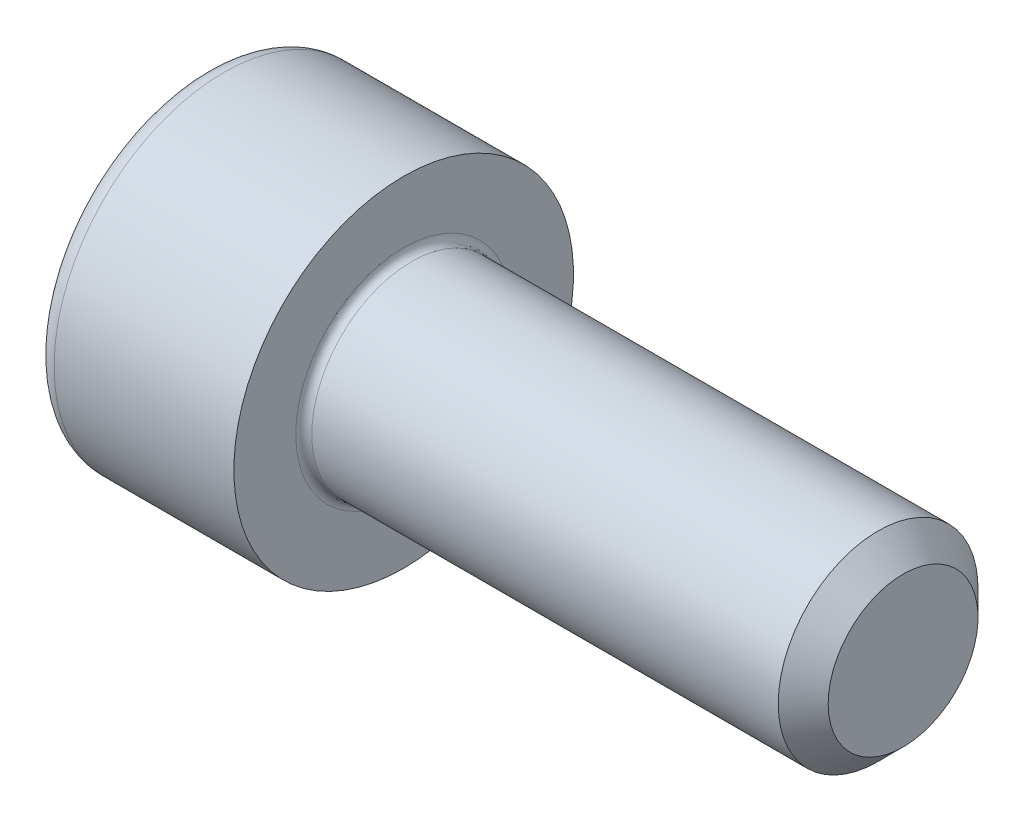
ISO-10303-21;
HEADER;
FILE_DESCRIPTION(('STEP AP214'),'2;1');
FILE_NAME('part.step','',(''),(''),'','','');
FILE_SCHEMA(('AUTOMOTIVE_DESIGN { 1 0 10303 214 1 1 1 1 }'));
ENDSEC;
DATA;
#1=APPLICATION_CONTEXT('core data for automotive mechanical design processes');
#2=APPLICATION_PROTOCOL_DEFINITION('international standard','automotive_design',2000,#1);
#3=PRODUCT_CONTEXT('',#1,'mechanical');
#4=PRODUCT('Part','Part','',(#3));
#5=PRODUCT_RELATED_PRODUCT_CATEGORY('part','',(#4));
#6=PRODUCT_DEFINITION_FORMATION('','',#4);
#7=PRODUCT_DEFINITION_CONTEXT('part definition',#1,'design');
#8=PRODUCT_DEFINITION('design','',#6,#7);
#9=PRODUCT_DEFINITION_SHAPE('','',#8);
#10=(LENGTH_UNIT() NAMED_UNIT(*) SI_UNIT(.MILLI.,.METRE.));
#11=(NAMED_UNIT(*) PLANE_ANGLE_UNIT() SI_UNIT($,.RADIAN.));
#12=(NAMED_UNIT(*) SI_UNIT($,.STERADIAN.) SOLID_ANGLE_UNIT());
#13=UNCERTAINTY_MEASURE_WITH_UNIT(LENGTH_MEASURE(1.E-05),#10,'distance_accuracy_value','');
#14=(GEOMETRIC_REPRESENTATION_CONTEXT(3) GLOBAL_UNCERTAINTY_ASSIGNED_CONTEXT((#13)) GLOBAL_UNIT_ASSIGNED_CONTEXT((#10,
#11,#12)) REPRESENTATION_CONTEXT('',''));
#15=CARTESIAN_POINT('',(0.,0.,0.));
#16=DIRECTION('',(0.,0.,1.));
#17=DIRECTION('',(1.,0.,0.));
#18=AXIS2_PLACEMENT_3D('',#15,#16,#17);
#19=CARTESIAN_POINT('',(-1.99999999995271,0.,0.));
#20=DIRECTION('',(-1.,0.,0.));
#21=DIRECTION('',(0.,0.,1.));
#22=AXIS2_PLACEMENT_3D('',#19,#20,#21);
#23=CONICAL_SURFACE('',#22,1.83319999985088,1.04719755109013);
#24=CARTESIAN_POINT('',(-0.941601486488253,-1.13686837721616E-10,0.));
#25=VERTEX_POINT('',#24);
#26=VERTEX_LOOP('',#25);
#27=FACE_BOUND('',#26,.T.);
#28=CARTESIAN_POINT('',(-2.00000000001834,0.,0.));
#29=DIRECTION('',(-1.,0.,0.));
#30=DIRECTION('',(0.,0.,1.));
#31=AXIS2_PLACEMENT_3D('',#28,#29,#30);
#32=CIRCLE('',#31,1.83319999996456);
#33=CARTESIAN_POINT('',(-2.00000000001834,-0.916599999982282,-1.58759777018694));
#34=VERTEX_POINT('',#33);
#35=CARTESIAN_POINT('',(-2.00000000001834,-1.83319999996456,0.));
#36=VERTEX_POINT('',#35);
#37=EDGE_CURVE('E88',#34,#36,#32,.T.);
#38=ORIENTED_EDGE('',*,*,#37,.T.);
#39=CARTESIAN_POINT('',(-2.00000000001834,0.,0.));
#40=DIRECTION('',(-1.,0.,0.));
#41=DIRECTION('',(0.,0.,1.));
#42=AXIS2_PLACEMENT_3D('',#39,#40,#41);
#43=CIRCLE('',#42,1.83319999996456);
#44=CARTESIAN_POINT('',(-2.00000000001834,-0.916599999982281,1.58759777018694));
#45=VERTEX_POINT('',#44);
#46=EDGE_CURVE('E83',#36,#45,#43,.T.);
#47=ORIENTED_EDGE('',*,*,#46,.T.);
#48=CARTESIAN_POINT('',(-2.00000000001834,0.,0.));
#49=DIRECTION('',(-1.,0.,0.));
#50=DIRECTION('',(0.,0.,1.));
#51=AXIS2_PLACEMENT_3D('',#48,#49,#50);
#52=CIRCLE('',#51,1.83319999996456);
#53=CARTESIAN_POINT('',(-1.99999999995271,0.916599999925436,1.58759777008849));
#54=VERTEX_POINT('',#53);
#55=EDGE_CURVE('E85',#45,#54,#52,.T.);
#56=ORIENTED_EDGE('',*,*,#55,.T.);
#57=CARTESIAN_POINT('',(-1.99999999995271,0.,0.));
#58=DIRECTION('',(-1.,0.,0.));
#59=DIRECTION('',(0.,0.,1.));
#60=AXIS2_PLACEMENT_3D('',#57,#58,#59);
#61=CIRCLE('',#60,1.83319999985088);
#62=CARTESIAN_POINT('',(-1.99999999995271,1.83319999985088,0.));
#63=VERTEX_POINT('',#62);
#64=EDGE_CURVE('E99',#54,#63,#61,.T.);
#65=ORIENTED_EDGE('',*,*,#64,.T.);
#66=CARTESIAN_POINT('',(-2.00000000001834,0.,0.));
#67=DIRECTION('',(-1.,0.,0.));
#68=DIRECTION('',(0.,0.,1.));
#69=AXIS2_PLACEMENT_3D('',#66,#67,#68);
#70=CIRCLE('',#69,1.83319999996456);
#71=CARTESIAN_POINT('',(-2.00000000001834,0.91659999998228,-1.58759777018694));
#72=VERTEX_POINT('',#71);
#73=EDGE_CURVE('E186',#63,#72,#70,.T.);
#74=ORIENTED_EDGE('',*,*,#73,.T.);
#75=CARTESIAN_POINT('',(-2.00000000001834,0.,0.));
#76=DIRECTION('',(-1.,0.,0.));
#77=DIRECTION('',(0.,0.,1.));
#78=AXIS2_PLACEMENT_3D('',#75,#76,#77);
#79=CIRCLE('',#78,1.83319999996456);
#80=EDGE_CURVE('E184',#72,#34,#79,.T.);
#81=ORIENTED_EDGE('',*,*,#80,.T.);
#82=EDGE_LOOP('',(#38,#47,#56,#65,#74,#81));
#83=FACE_BOUND('',#82,.T.);
#84=ADVANCED_FACE('F16',(#27,#83),#23,.F.);
#85=CARTESIAN_POINT('',(-2.,0.,0.));
#86=DIRECTION('',(-1.,0.,0.));
#87=DIRECTION('',(0.,-1.,0.));
#88=AXIS2_PLACEMENT_3D('',#85,#86,#87);
#89=PLANE('',#88);
#90=ORIENTED_EDGE('',*,*,#55,.F.);
#91=DIRECTION('',(0.,-1.,0.));
#92=VECTOR('',#91,1.);
#93=CARTESIAN_POINT('',(-2.,-0.9166,1.58759777021763));
#94=LINE('',#93,#92);
#95=EDGE_CURVE('E93',#45,#54,#94,.F.);
#96=ORIENTED_EDGE('',*,*,#95,.T.);
#97=EDGE_LOOP('',(#90,#96));
#98=FACE_BOUND('',#97,.T.);
#99=ADVANCED_FACE('F96',(#98),#89,.F.);
#100=CARTESIAN_POINT('',(-2.,0.,0.));
#101=DIRECTION('',(-1.,0.,0.));
#102=DIRECTION('',(0.,-1.,0.));
#103=AXIS2_PLACEMENT_3D('',#100,#101,#102);
#104=PLANE('',#103);
#105=ORIENTED_EDGE('',*,*,#64,.F.);
#106=DIRECTION('',(0.,-0.5,0.866025403784439));
#107=VECTOR('',#106,1.);
#108=CARTESIAN_POINT('',(-2.,0.9166,1.58759777021763));
#109=LINE('',#108,#107);
#110=EDGE_CURVE('E162',#54,#63,#109,.F.);
#111=ORIENTED_EDGE('',*,*,#110,.T.);
#112=EDGE_LOOP('',(#105,#111));
#113=FACE_BOUND('',#112,.T.);
#114=ADVANCED_FACE('F293',(#113),#104,.F.);
#115=CARTESIAN_POINT('',(-2.,0.,0.));
#116=DIRECTION('',(-1.,0.,0.));
#117=DIRECTION('',(0.,-1.,0.));
#118=AXIS2_PLACEMENT_3D('',#115,#116,#117);
#119=PLANE('',#118);
#120=ORIENTED_EDGE('',*,*,#73,.F.);
#121=DIRECTION('',(0.,0.5,0.866025403784439));
#122=VECTOR('',#121,1.);
#123=CARTESIAN_POINT('',(-2.,1.8332,0.));
#124=LINE('',#123,#122);
#125=EDGE_CURVE('E151',#63,#72,#124,.F.);
#126=ORIENTED_EDGE('',*,*,#125,.T.);
#127=EDGE_LOOP('',(#120,#126));
#128=FACE_BOUND('',#127,.T.);
#129=ADVANCED_FACE('F297',(#128),#119,.F.);
#130=CARTESIAN_POINT('',(-2.,0.,0.));
#131=DIRECTION('',(-1.,0.,0.));
#132=DIRECTION('',(0.,-1.,0.));
#133=AXIS2_PLACEMENT_3D('',#130,#131,#132);
#134=PLANE('',#133);
#135=ORIENTED_EDGE('',*,*,#80,.F.);
#136=DIRECTION('',(0.,1.,0.));
#137=VECTOR('',#136,1.);
#138=CARTESIAN_POINT('',(-2.,0.9166,-1.58759777021763));
#139=LINE('',#138,#137);
#140=EDGE_CURVE('E139',#72,#34,#139,.F.);
#141=ORIENTED_EDGE('',*,*,#140,.T.);
#142=EDGE_LOOP('',(#135,#141));
#143=FACE_BOUND('',#142,.T.);
#144=ADVANCED_FACE('F304',(#143),#134,.F.);
#145=CARTESIAN_POINT('',(-2.,0.,0.));
#146=DIRECTION('',(-1.,0.,0.));
#147=DIRECTION('',(0.,-1.,0.));
#148=AXIS2_PLACEMENT_3D('',#145,#146,#147);
#149=PLANE('',#148);
#150=ORIENTED_EDGE('',*,*,#37,.F.);
#151=DIRECTION('',(0.,0.5,-0.866025403784438));
#152=VECTOR('',#151,1.);
#153=CARTESIAN_POINT('',(-2.,-0.9166,-1.58759777021763));
#154=LINE('',#153,#152);
#155=EDGE_CURVE('E125',#34,#36,#154,.F.);
#156=ORIENTED_EDGE('',*,*,#155,.T.);
#157=EDGE_LOOP('',(#150,#156));
#158=FACE_BOUND('',#157,.T.);
#159=ADVANCED_FACE('F307',(#158),#149,.F.);
#160=CARTESIAN_POINT('',(-2.,0.,0.));
#161=DIRECTION('',(-1.,0.,0.));
#162=DIRECTION('',(0.,-1.,0.));
#163=AXIS2_PLACEMENT_3D('',#160,#161,#162);
#164=PLANE('',#163);
#165=ORIENTED_EDGE('',*,*,#46,.F.);
#166=DIRECTION('',(0.,-0.5,-0.866025403784438));
#167=VECTOR('',#166,1.);
#168=CARTESIAN_POINT('',(-2.,-1.8332,0.));
#169=LINE('',#168,#167);
#170=EDGE_CURVE('E101',#36,#45,#169,.F.);
#171=ORIENTED_EDGE('',*,*,#170,.T.);
#172=EDGE_LOOP('',(#165,#171));
#173=FACE_BOUND('',#172,.T.);
#174=ADVANCED_FACE('F102',(#173),#164,.F.);
#175=CARTESIAN_POINT('',(-2.,-0.9166,1.58759777021763));
#176=DIRECTION('',(0.,0.,1.));
#177=DIRECTION('',(0.,-1.,0.));
#178=AXIS2_PLACEMENT_3D('',#175,#176,#177);
#179=PLANE('',#178);
#180=DIRECTION('',(1.,0.,0.));
#181=VECTOR('',#180,1.);
#182=CARTESIAN_POINT('',(-2.,0.9166,1.58759777021763));
#183=LINE('',#182,#181);
#184=CARTESIAN_POINT('',(-4.,0.916599999999999,1.58759777021763));
#185=VERTEX_POINT('',#184);
#186=EDGE_CURVE('E113',#185,#54,#183,.T.);
#187=ORIENTED_EDGE('',*,*,#186,.T.);
#188=ORIENTED_EDGE('',*,*,#95,.F.);
#189=DIRECTION('',(1.,0.,0.));
#190=VECTOR('',#189,1.);
#191=CARTESIAN_POINT('',(-2.,-0.9166,1.58759777021763));
#192=LINE('',#191,#190);
#193=CARTESIAN_POINT('',(-4.,-0.9166,1.58759777021763));
#194=VERTEX_POINT('',#193);
#195=EDGE_CURVE('E106',#45,#194,#192,.F.);
#196=ORIENTED_EDGE('',*,*,#195,.T.);
#197=DIRECTION('',(0.,1.,0.));
#198=VECTOR('',#197,1.);
#199=CARTESIAN_POINT('',(-4.,1.8332,1.58759777021763));
#200=LINE('',#199,#198);
#201=EDGE_CURVE('E120',#194,#185,#200,.T.);
#202=ORIENTED_EDGE('',*,*,#201,.T.);
#203=EDGE_LOOP('',(#187,#188,#196,#202));
#204=FACE_BOUND('',#203,.T.);
#205=ADVANCED_FACE('F110',(#204),#179,.F.);
#206=CARTESIAN_POINT('',(-2.,0.9166,1.58759777021763));
#207=DIRECTION('',(0.,0.866025403784439,0.5));
#208=DIRECTION('',(0.,-0.5,0.866025403784439));
#209=AXIS2_PLACEMENT_3D('',#206,#207,#208);
#210=PLANE('',#209);
#211=DIRECTION('',(1.,0.,0.));
#212=VECTOR('',#211,1.);
#213=CARTESIAN_POINT('',(-2.,1.8332,0.));
#214=LINE('',#213,#212);
#215=CARTESIAN_POINT('',(-4.,1.8332,0.));
#216=VERTEX_POINT('',#215);
#217=EDGE_CURVE('E156',#216,#63,#214,.T.);
#218=ORIENTED_EDGE('',*,*,#217,.T.);
#219=ORIENTED_EDGE('',*,*,#110,.F.);
#220=ORIENTED_EDGE('',*,*,#186,.F.);
#221=DIRECTION('',(0.,0.500000000000001,-0.866025403784438));
#222=VECTOR('',#221,1.);
#223=CARTESIAN_POINT('',(-4.,0.9166,1.58759777021763));
#224=LINE('',#223,#222);
#225=EDGE_CURVE('E122',#185,#216,#224,.T.);
#226=ORIENTED_EDGE('',*,*,#225,.T.);
#227=EDGE_LOOP('',(#218,#219,#220,#226));
#228=FACE_BOUND('',#227,.T.);
#229=ADVANCED_FACE('F289',(#228),#210,.F.);
#230=CARTESIAN_POINT('',(-2.,1.8332,0.));
#231=DIRECTION('',(0.,0.866025403784439,-0.5));
#232=DIRECTION('',(0.,0.5,0.866025403784439));
#233=AXIS2_PLACEMENT_3D('',#230,#231,#232);
#234=PLANE('',#233);
#235=DIRECTION('',(1.,0.,0.));
#236=VECTOR('',#235,1.);
#237=CARTESIAN_POINT('',(-2.,0.9166,-1.58759777021763));
#238=LINE('',#237,#236);
#239=CARTESIAN_POINT('',(-4.,0.9166,-1.58759777021763));
#240=VERTEX_POINT('',#239);
#241=EDGE_CURVE('E144',#240,#72,#238,.T.);
#242=ORIENTED_EDGE('',*,*,#241,.T.);
#243=ORIENTED_EDGE('',*,*,#125,.F.);
#244=ORIENTED_EDGE('',*,*,#217,.F.);
#245=DIRECTION('',(0.,-0.499999999999999,-0.866025403784439));
#246=VECTOR('',#245,1.);
#247=CARTESIAN_POINT('',(-4.,1.8332,0.));
#248=LINE('',#247,#246);
#249=EDGE_CURVE('E146',#216,#240,#248,.T.);
#250=ORIENTED_EDGE('',*,*,#249,.T.);
#251=EDGE_LOOP('',(#242,#243,#244,#250));
#252=FACE_BOUND('',#251,.T.);
#253=ADVANCED_FACE('F300',(#252),#234,.F.);
#254=CARTESIAN_POINT('',(-2.,0.9166,-1.58759777021763));
#255=DIRECTION('',(0.,0.,-1.));
#256=DIRECTION('',(0.,1.,0.));
#257=AXIS2_PLACEMENT_3D('',#254,#255,#256);
#258=PLANE('',#257);
#259=DIRECTION('',(1.,0.,0.));
#260=VECTOR('',#259,1.);
#261=CARTESIAN_POINT('',(-2.,-0.9166,-1.58759777021763));
#262=LINE('',#261,#260);
#263=CARTESIAN_POINT('',(-4.,-0.9166,-1.58759777021763));
#264=VERTEX_POINT('',#263);
#265=EDGE_CURVE('E127',#264,#34,#262,.T.);
#266=ORIENTED_EDGE('',*,*,#265,.T.);
#267=ORIENTED_EDGE('',*,*,#140,.F.);
#268=ORIENTED_EDGE('',*,*,#241,.F.);
#269=DIRECTION('',(0.,1.,0.));
#270=VECTOR('',#269,1.);
#271=CARTESIAN_POINT('',(-4.,1.8332,-1.58759777021763));
#272=LINE('',#271,#270);
#273=EDGE_CURVE('E130',#240,#264,#272,.F.);
#274=ORIENTED_EDGE('',*,*,#273,.T.);
#275=EDGE_LOOP('',(#266,#267,#268,#274));
#276=FACE_BOUND('',#275,.T.);
#277=ADVANCED_FACE('F305',(#276),#258,.F.);
#278=CARTESIAN_POINT('',(-2.,-0.9166,-1.58759777021763));
#279=DIRECTION('',(0.,-0.866025403784438,-0.5));
#280=DIRECTION('',(0.,0.5,-0.866025403784438));
#281=AXIS2_PLACEMENT_3D('',#278,#279,#280);
#282=PLANE('',#281);
#283=DIRECTION('',(1.,0.,0.));
#284=VECTOR('',#283,1.);
#285=CARTESIAN_POINT('',(-2.,-1.8332,0.));
#286=LINE('',#285,#284);
#287=CARTESIAN_POINT('',(-4.,-1.8332,0.));
#288=VERTEX_POINT('',#287);
#289=EDGE_CURVE('E107',#288,#36,#286,.T.);
#290=ORIENTED_EDGE('',*,*,#289,.T.);
#291=ORIENTED_EDGE('',*,*,#155,.F.);
#292=ORIENTED_EDGE('',*,*,#265,.F.);
#293=DIRECTION('',(0.,-0.5,0.866025403784439));
#294=VECTOR('',#293,1.);
#295=CARTESIAN_POINT('',(-4.,-0.9166,-1.58759777021763));
#296=LINE('',#295,#294);
#297=EDGE_CURVE('E128',#264,#288,#296,.T.);
#298=ORIENTED_EDGE('',*,*,#297,.T.);
#299=EDGE_LOOP('',(#290,#291,#292,#298));
#300=FACE_BOUND('',#299,.T.);
#301=ADVANCED_FACE('F280',(#300),#282,.F.);
#302=CARTESIAN_POINT('',(-2.,-1.8332,0.));
#303=DIRECTION('',(0.,-0.866025403784438,0.5));
#304=DIRECTION('',(0.,-0.5,-0.866025403784438));
#305=AXIS2_PLACEMENT_3D('',#302,#303,#304);
#306=PLANE('',#305);
#307=ORIENTED_EDGE('',*,*,#195,.F.);
#308=ORIENTED_EDGE('',*,*,#170,.F.);
#309=ORIENTED_EDGE('',*,*,#289,.F.);
#310=DIRECTION('',(0.,0.5,0.866025403784439));
#311=VECTOR('',#310,1.);
#312=CARTESIAN_POINT('',(-4.,-1.8332,0.));
#313=LINE('',#312,#311);
#314=EDGE_CURVE('E118',#288,#194,#313,.T.);
#315=ORIENTED_EDGE('',*,*,#314,.T.);
#316=EDGE_LOOP('',(#307,#308,#309,#315));
#317=FACE_BOUND('',#316,.T.);
#318=ADVANCED_FACE('F116',(#317),#306,.F.);
#319=CARTESIAN_POINT('',(-4.,1.8332,0.));
#320=DIRECTION('',(1.,0.,0.));
#321=DIRECTION('',(0.,1.,0.));
#322=AXIS2_PLACEMENT_3D('',#319,#320,#321);
#323=PLANE('',#322);
#324=CARTESIAN_POINT('',(-4.,0.,0.));
#325=DIRECTION('',(1.,0.,0.));
#326=DIRECTION('',(0.,-1.,0.));
#327=AXIS2_PLACEMENT_3D('',#324,#325,#326);
#328=CIRCLE('',#327,3.);
#329=CARTESIAN_POINT('',(-4.,-3.,0.));
#330=VERTEX_POINT('',#329);
#331=CARTESIAN_POINT('',(-4.,3.,0.));
#332=VERTEX_POINT('',#331);
#333=EDGE_CURVE('E134',#330,#332,#328,.T.);
#334=ORIENTED_EDGE('',*,*,#333,.F.);
#335=CARTESIAN_POINT('',(-4.,0.,0.));
#336=DIRECTION('',(1.,0.,0.));
#337=DIRECTION('',(0.,1.,0.));
#338=AXIS2_PLACEMENT_3D('',#335,#336,#337);
#339=CIRCLE('',#338,3.);
#340=EDGE_CURVE('E249',#332,#330,#339,.T.);
#341=ORIENTED_EDGE('',*,*,#340,.F.);
#342=EDGE_LOOP('',(#334,#341));
#343=FACE_BOUND('',#342,.T.);
#344=ORIENTED_EDGE('',*,*,#297,.F.);
#345=ORIENTED_EDGE('',*,*,#273,.F.);
#346=ORIENTED_EDGE('',*,*,#249,.F.);
#347=ORIENTED_EDGE('',*,*,#225,.F.);
#348=ORIENTED_EDGE('',*,*,#201,.F.);
#349=ORIENTED_EDGE('',*,*,#314,.F.);
#350=EDGE_LOOP('',(#344,#345,#346,#347,#348,#349));
#351=FACE_BOUND('',#350,.T.);
#352=ADVANCED_FACE('F258',(#343,#351),#323,.F.);
#353=CARTESIAN_POINT('',(-3.6,0.,0.));
#354=DIRECTION('',(-1.,0.,0.));
#355=DIRECTION('',(0.,1.,0.));
#356=AXIS2_PLACEMENT_3D('',#353,#354,#355);
#357=TOROIDAL_SURFACE('',#356,3.,0.4);
#358=ORIENTED_EDGE('',*,*,#333,.T.);
#359=ORIENTED_EDGE('',*,*,#340,.T.);
#360=EDGE_LOOP('',(#358,#359));
#361=FACE_BOUND('',#360,.T.);
#362=CARTESIAN_POINT('',(-3.6,0.,0.));
#363=DIRECTION('',(-1.,0.,0.));
#364=DIRECTION('',(0.,-1.,0.));
#365=AXIS2_PLACEMENT_3D('',#362,#363,#364);
#366=CIRCLE('',#365,3.4);
#367=CARTESIAN_POINT('',(-3.6,-3.4,0.));
#368=VERTEX_POINT('',#367);
#369=EDGE_CURVE('E181',#368,#368,#366,.F.);
#370=ORIENTED_EDGE('',*,*,#369,.F.);
#371=EDGE_LOOP('',(#370));
#372=FACE_BOUND('',#371,.T.);
#373=ADVANCED_FACE('F253',(#361,#372),#357,.T.);
#374=CARTESIAN_POINT('',(-0.94160148652158,0.,0.));
#375=DIRECTION('',(-1.,0.,0.));
#376=DIRECTION('',(0.,-1.,0.));
#377=AXIS2_PLACEMENT_3D('',#374,#375,#376);
#378=CYLINDRICAL_SURFACE('',#377,3.4);
#379=ORIENTED_EDGE('',*,*,#369,.T.);
#380=EDGE_LOOP('',(#379));
#381=FACE_BOUND('',#380,.T.);
#382=CARTESIAN_POINT('',(0.,0.,0.));
#383=DIRECTION('',(-1.,0.,0.));
#384=DIRECTION('',(0.,-1.,0.));
#385=AXIS2_PLACEMENT_3D('',#382,#383,#384);
#386=CIRCLE('',#385,3.4);
#387=CARTESIAN_POINT('',(0.,-3.4,0.));
#388=VERTEX_POINT('',#387);
#389=EDGE_CURVE('E179',#388,#388,#386,.T.);
#390=ORIENTED_EDGE('',*,*,#389,.T.);
#391=EDGE_LOOP('',(#390));
#392=FACE_BOUND('',#391,.T.);
#393=ADVANCED_FACE('F257',(#381,#392),#378,.T.);
#394=CARTESIAN_POINT('',(10.,0.,0.));
#395=DIRECTION('',(1.,0.,0.));
#396=DIRECTION('',(0.,1.,0.));
#397=AXIS2_PLACEMENT_3D('',#394,#395,#396);
#398=PLANE('',#397);
#399=CARTESIAN_POINT('',(9.99999999999091,0.,0.));
#400=DIRECTION('',(-1.,0.,0.));
#401=DIRECTION('',(0.,0.,1.));
#402=AXIS2_PLACEMENT_3D('',#399,#400,#401);
#403=CIRCLE('',#402,1.49999999996453);
#404=CARTESIAN_POINT('',(9.99999999999091,0.,1.49999999996453));
#405=VERTEX_POINT('',#404);
#406=EDGE_CURVE('E175',#405,#405,#403,.T.);
#407=ORIENTED_EDGE('',*,*,#406,.F.);
#408=EDGE_LOOP('',(#407));
#409=FACE_BOUND('',#408,.T.);
#410=ADVANCED_FACE('F226',(#409),#398,.T.);
#411=CARTESIAN_POINT('',(0.,3.4,0.));
#412=DIRECTION('',(-1.,0.,0.));
#413=DIRECTION('',(0.,-1.,0.));
#414=AXIS2_PLACEMENT_3D('',#411,#412,#413);
#415=PLANE('',#414);
#416=CARTESIAN_POINT('',(0.,0.,0.));
#417=DIRECTION('',(1.,0.,0.));
#418=DIRECTION('',(0.,-1.,0.));
#419=AXIS2_PLACEMENT_3D('',#416,#417,#418);
#420=CIRCLE('',#419,2.16);
#421=CARTESIAN_POINT('',(0.,2.16,0.));
#422=VERTEX_POINT('',#421);
#423=CARTESIAN_POINT('',(0.,-2.16,0.));
#424=VERTEX_POINT('',#423);
#425=EDGE_CURVE('E178',#422,#424,#420,.F.);
#426=ORIENTED_EDGE('',*,*,#425,.T.);
#427=CARTESIAN_POINT('',(0.,0.,0.));
#428=DIRECTION('',(1.,0.,0.));
#429=DIRECTION('',(0.,1.,0.));
#430=AXIS2_PLACEMENT_3D('',#427,#428,#429);
#431=CIRCLE('',#430,2.16);
#432=EDGE_CURVE('E35',#424,#422,#431,.F.);
#433=ORIENTED_EDGE('',*,*,#432,.T.);
#434=EDGE_LOOP('',(#426,#433));
#435=FACE_BOUND('',#434,.T.);
#436=ORIENTED_EDGE('',*,*,#389,.F.);
#437=EDGE_LOOP('',(#436));
#438=FACE_BOUND('',#437,.T.);
#439=ADVANCED_FACE('F217',(#435,#438),#415,.F.);
#440=CARTESIAN_POINT('',(9.50000000000273,0.,0.));
#441=DIRECTION('',(-1.,0.,0.));
#442=DIRECTION('',(0.,0.,1.));
#443=AXIS2_PLACEMENT_3D('',#440,#441,#442);
#444=CONICAL_SURFACE('',#443,1.99999999995271,0.785398163397448);
#445=ORIENTED_EDGE('',*,*,#406,.T.);
#446=EDGE_LOOP('',(#445));
#447=FACE_BOUND('',#446,.T.);
#448=CARTESIAN_POINT('',(9.5,0.,0.));
#449=DIRECTION('',(-1.,0.,0.));
#450=DIRECTION('',(0.,-1.,0.));
#451=AXIS2_PLACEMENT_3D('',#448,#449,#450);
#452=CIRCLE('',#451,2.);
#453=CARTESIAN_POINT('',(9.5,-2.,0.));
#454=VERTEX_POINT('',#453);
#455=EDGE_CURVE('E27',#454,#454,#452,.T.);
#456=ORIENTED_EDGE('',*,*,#455,.F.);
#457=EDGE_LOOP('',(#456));
#458=FACE_BOUND('',#457,.T.);
#459=ADVANCED_FACE('F206',(#447,#458),#444,.T.);
#460=CARTESIAN_POINT('',(0.16,0.,0.));
#461=DIRECTION('',(-1.,0.,0.));
#462=DIRECTION('',(0.,1.,0.));
#463=AXIS2_PLACEMENT_3D('',#460,#461,#462);
#464=TOROIDAL_SURFACE('',#463,2.16,0.16);
#465=CARTESIAN_POINT('',(0.16,0.,0.));
#466=DIRECTION('',(-1.,0.,0.));
#467=DIRECTION('',(0.,-1.,0.));
#468=AXIS2_PLACEMENT_3D('',#465,#466,#467);
#469=CIRCLE('',#468,2.);
#470=CARTESIAN_POINT('',(0.16,-2.,0.));
#471=VERTEX_POINT('',#470);
#472=EDGE_CURVE('E11',#471,#471,#469,.F.);
#473=ORIENTED_EDGE('',*,*,#472,.F.);
#474=EDGE_LOOP('',(#473));
#475=FACE_BOUND('',#474,.T.);
#476=ORIENTED_EDGE('',*,*,#425,.F.);
#477=ORIENTED_EDGE('',*,*,#432,.F.);
#478=EDGE_LOOP('',(#476,#477));
#479=FACE_BOUND('',#478,.T.);
#480=ADVANCED_FACE('F194',(#475,#479),#464,.F.);
#481=CARTESIAN_POINT('',(-0.94160148652158,0.,0.));
#482=DIRECTION('',(-1.,0.,0.));
#483=DIRECTION('',(0.,-1.,0.));
#484=AXIS2_PLACEMENT_3D('',#481,#482,#483);
#485=CYLINDRICAL_SURFACE('',#484,2.);
#486=ORIENTED_EDGE('',*,*,#472,.T.);
#487=EDGE_LOOP('',(#486));
#488=FACE_BOUND('',#487,.T.);
#489=ORIENTED_EDGE('',*,*,#455,.T.);
#490=EDGE_LOOP('',(#489));
#491=FACE_BOUND('',#490,.T.);
#492=ADVANCED_FACE('F205',(#488,#491),#485,.T.);
#493=CLOSED_SHELL('',(#84,#99,#114,#129,#144,#159,#174,#205,#229,#253,#277,#301,#318,#352,#373,
#393,#410,#439,#459,#480,#492));
#494=MANIFOLD_SOLID_BREP('B1',#493);
#495=ADVANCED_BREP_SHAPE_REPRESENTATION('',(#18,#494),#14);
#496=SHAPE_DEFINITION_REPRESENTATION(#9,#495);
ENDSEC;
END-ISO-10303-21;
